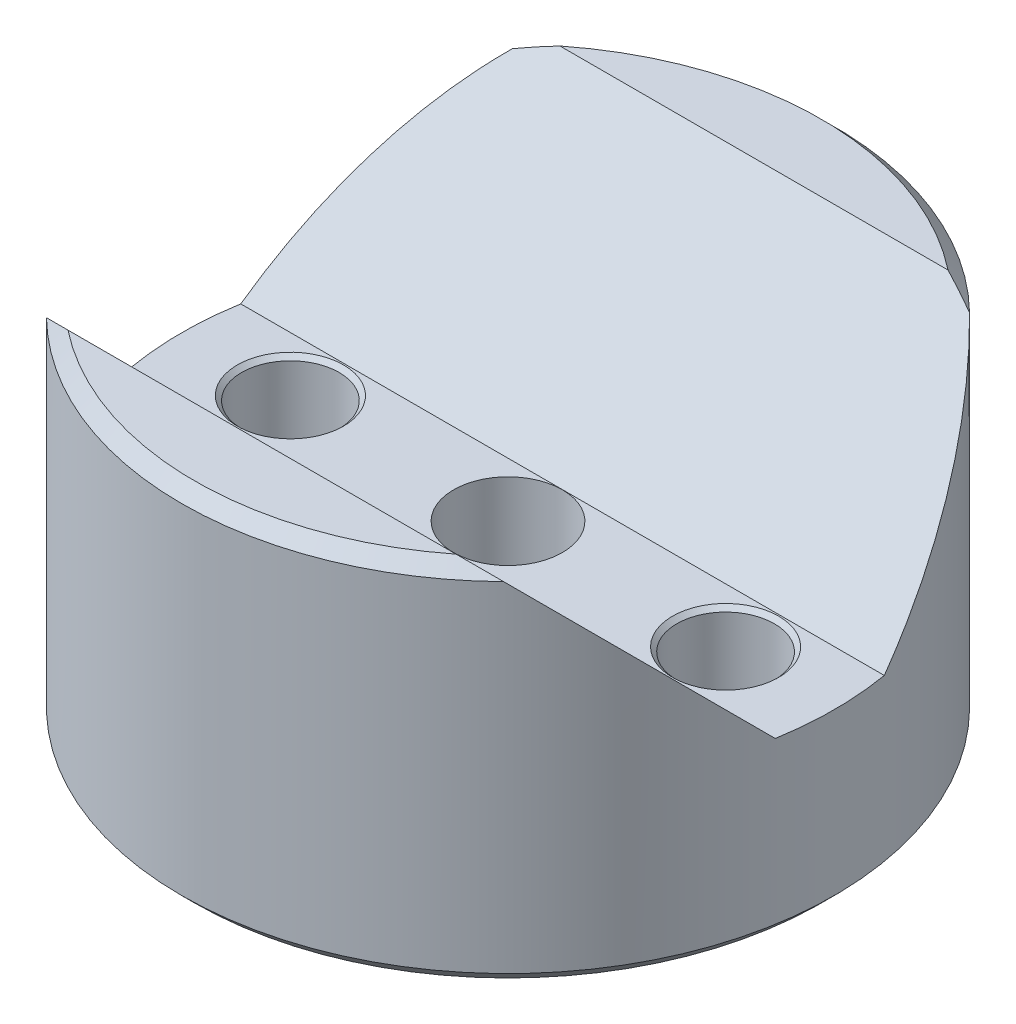
ISO-10303-21;
HEADER;
FILE_DESCRIPTION(('STEP AP214'),'2;1');
FILE_NAME('part.step','',(''),(''),'','','');
FILE_SCHEMA(('AUTOMOTIVE_DESIGN { 1 0 10303 214 1 1 1 1 }'));
ENDSEC;
DATA;
#1=APPLICATION_CONTEXT('core data for automotive mechanical design processes');
#2=APPLICATION_PROTOCOL_DEFINITION('international standard','automotive_design',2000,#1);
#3=PRODUCT_CONTEXT('',#1,'mechanical');
#4=PRODUCT('Part','Part','',(#3));
#5=PRODUCT_RELATED_PRODUCT_CATEGORY('part','',(#4));
#6=PRODUCT_DEFINITION_FORMATION('','',#4);
#7=PRODUCT_DEFINITION_CONTEXT('part definition',#1,'design');
#8=PRODUCT_DEFINITION('design','',#6,#7);
#9=PRODUCT_DEFINITION_SHAPE('','',#8);
#10=(LENGTH_UNIT() NAMED_UNIT(*) SI_UNIT(.MILLI.,.METRE.));
#11=(NAMED_UNIT(*) PLANE_ANGLE_UNIT() SI_UNIT($,.RADIAN.));
#12=(NAMED_UNIT(*) SI_UNIT($,.STERADIAN.) SOLID_ANGLE_UNIT());
#13=UNCERTAINTY_MEASURE_WITH_UNIT(LENGTH_MEASURE(1.E-05),#10,'distance_accuracy_value','');
#14=(GEOMETRIC_REPRESENTATION_CONTEXT(3) GLOBAL_UNCERTAINTY_ASSIGNED_CONTEXT((#13)) GLOBAL_UNIT_ASSIGNED_CONTEXT((#10,
#11,#12)) REPRESENTATION_CONTEXT('',''));
#15=CARTESIAN_POINT('',(0.,0.,0.));
#16=DIRECTION('',(0.,0.,1.));
#17=DIRECTION('',(1.,0.,0.));
#18=AXIS2_PLACEMENT_3D('',#15,#16,#17);
#19=CARTESIAN_POINT('',(0.,10.668,0.));
#20=DIRECTION('',(0.,-1.,0.));
#21=DIRECTION('',(0.,0.,-1.));
#22=AXIS2_PLACEMENT_3D('',#19,#20,#21);
#23=PLANE('',#22);
#24=DIRECTION('',(1.,0.,0.));
#25=VECTOR('',#24,1.);
#26=CARTESIAN_POINT('',(-9.525,10.668,7.17969209080187));
#27=LINE('',#26,#25);
#28=CARTESIAN_POINT('',(-5.66257516341084,10.668,7.17969209080187));
#29=VERTEX_POINT('',#28);
#30=CARTESIAN_POINT('',(5.66257516341084,10.668,7.17969209080187));
#31=VERTEX_POINT('',#30);
#32=EDGE_CURVE('E126',#29,#31,#27,.T.);
#33=ORIENTED_EDGE('',*,*,#32,.F.);
#34=CARTESIAN_POINT('',(0.,10.668,0.));
#35=DIRECTION('',(0.,-1.,0.));
#36=DIRECTION('',(0.,0.,-1.));
#37=AXIS2_PLACEMENT_3D('',#34,#35,#36);
#38=CIRCLE('',#37,9.14400000000001);
#39=EDGE_CURVE('E193',#29,#31,#38,.F.);
#40=ORIENTED_EDGE('',*,*,#39,.T.);
#41=EDGE_LOOP('',(#33,#40));
#42=FACE_BOUND('',#41,.T.);
#43=ADVANCED_FACE('F31',(#42),#23,.F.);
#44=DIRECTION('',(1.,0.,0.));
#45=VECTOR('',#44,1.);
#46=CARTESIAN_POINT('',(-9.525,10.668,-7.17969209080187));
#47=LINE('',#46,#45);
#48=CARTESIAN_POINT('',(-5.66257516341084,10.668,-7.17969209080187));
#49=VERTEX_POINT('',#48);
#50=CARTESIAN_POINT('',(5.66257516341084,10.668,-7.17969209080187));
#51=VERTEX_POINT('',#50);
#52=EDGE_CURVE('E124',#49,#51,#47,.T.);
#53=ORIENTED_EDGE('',*,*,#52,.T.);
#54=CARTESIAN_POINT('',(0.,10.668,0.));
#55=DIRECTION('',(0.,-1.,0.));
#56=DIRECTION('',(0.,0.,-1.));
#57=AXIS2_PLACEMENT_3D('',#54,#55,#56);
#58=CIRCLE('',#57,9.14400000000001);
#59=EDGE_CURVE('E427',#51,#49,#58,.F.);
#60=ORIENTED_EDGE('',*,*,#59,.T.);
#61=EDGE_LOOP('',(#53,#60));
#62=FACE_BOUND('',#61,.T.);
#63=ADVANCED_FACE('F33',(#62),#23,.F.);
#64=CARTESIAN_POINT('',(0.,38.791315640334,0.));
#65=DIRECTION('',(0.,1.,0.));
#66=DIRECTION('',(0.,0.,1.));
#67=AXIS2_PLACEMENT_3D('',#64,#65,#66);
#68=CYLINDRICAL_SURFACE('',#67,9.525);
#69=CARTESIAN_POINT('',(0.,0.381000000000006,0.));
#70=DIRECTION('',(0.,1.,0.));
#71=DIRECTION('',(0.,0.,1.));
#72=AXIS2_PLACEMENT_3D('',#69,#70,#71);
#73=CIRCLE('',#72,9.525);
#74=CARTESIAN_POINT('',(0.,0.381000000000006,9.525));
#75=VERTEX_POINT('',#74);
#76=EDGE_CURVE('E423',#75,#75,#73,.T.);
#77=ORIENTED_EDGE('',*,*,#76,.T.);
#78=EDGE_LOOP('',(#77));
#79=FACE_BOUND('',#78,.T.);
#80=CARTESIAN_POINT('',(0.,3.48830790919814,0.));
#81=DIRECTION('',(0.,-0.707106781186548,0.707106781186547));
#82=DIRECTION('',(0.,0.707106781186547,0.707106781186548));
#83=AXIS2_PLACEMENT_3D('',#80,#81,#82);
#84=ELLIPSE('',#83,13.4703841816037,9.525);
#85=CARTESIAN_POINT('',(9.3910671006057,5.08,1.59169209080187));
#86=VERTEX_POINT('',#85);
#87=CARTESIAN_POINT('',(6.67108768151553,10.287,6.79869209080186));
#88=VERTEX_POINT('',#87);
#89=EDGE_CURVE('E118',#86,#88,#84,.T.);
#90=ORIENTED_EDGE('',*,*,#89,.T.);
#91=CARTESIAN_POINT('',(0.,10.287,0.));
#92=DIRECTION('',(0.,-1.,0.));
#93=DIRECTION('',(0.,0.,-1.));
#94=AXIS2_PLACEMENT_3D('',#91,#92,#93);
#95=CIRCLE('',#94,9.525);
#96=CARTESIAN_POINT('',(-6.67108768151552,10.287,6.79869209080187));
#97=VERTEX_POINT('',#96);
#98=EDGE_CURVE('E424',#88,#97,#95,.T.);
#99=ORIENTED_EDGE('',*,*,#98,.T.);
#100=CARTESIAN_POINT('',(-9.3910671006057,5.08,1.59169209080187));
#101=VERTEX_POINT('',#100);
#102=EDGE_CURVE('E107',#97,#101,#84,.T.);
#103=ORIENTED_EDGE('',*,*,#102,.T.);
#104=CARTESIAN_POINT('',(0.,5.08,0.));
#105=DIRECTION('',(0.,-1.,0.));
#106=DIRECTION('',(0.,0.,-1.));
#107=AXIS2_PLACEMENT_3D('',#104,#105,#106);
#108=CIRCLE('',#107,9.525);
#109=CARTESIAN_POINT('',(-9.3910671006057,5.08,-1.59169209080187));
#110=VERTEX_POINT('',#109);
#111=EDGE_CURVE('E121',#101,#110,#108,.T.);
#112=ORIENTED_EDGE('',*,*,#111,.T.);
#113=CARTESIAN_POINT('',(0.,3.48830790919814,0.));
#114=DIRECTION('',(0.,-0.707106781186548,-0.707106781186547));
#115=DIRECTION('',(0.,0.707106781186547,-0.707106781186548));
#116=AXIS2_PLACEMENT_3D('',#113,#114,#115);
#117=ELLIPSE('',#116,13.4703841816037,9.525);
#118=CARTESIAN_POINT('',(-6.67108768151553,10.287,-6.79869209080186));
#119=VERTEX_POINT('',#118);
#120=EDGE_CURVE('E109',#110,#119,#117,.T.);
#121=ORIENTED_EDGE('',*,*,#120,.T.);
#122=CARTESIAN_POINT('',(0.,10.287,0.));
#123=DIRECTION('',(0.,-1.,0.));
#124=DIRECTION('',(0.,0.,-1.));
#125=AXIS2_PLACEMENT_3D('',#122,#123,#124);
#126=CIRCLE('',#125,9.525);
#127=CARTESIAN_POINT('',(6.67108768151552,10.287,-6.79869209080187));
#128=VERTEX_POINT('',#127);
#129=EDGE_CURVE('E104',#119,#128,#126,.T.);
#130=ORIENTED_EDGE('',*,*,#129,.T.);
#131=CARTESIAN_POINT('',(9.3910671006057,5.08,-1.59169209080187));
#132=VERTEX_POINT('',#131);
#133=EDGE_CURVE('E98',#128,#132,#117,.T.);
#134=ORIENTED_EDGE('',*,*,#133,.T.);
#135=EDGE_CURVE('E102',#132,#86,#108,.T.);
#136=ORIENTED_EDGE('',*,*,#135,.T.);
#137=EDGE_LOOP('',(#90,#99,#103,#112,#121,#130,#134,#136));
#138=FACE_BOUND('',#137,.T.);
#139=ADVANCED_FACE('F101',(#79,#138),#68,.T.);
#140=CARTESIAN_POINT('',(9.525,0.,0.));
#141=DIRECTION('',(0.,1.,0.));
#142=DIRECTION('',(0.,0.,1.));
#143=AXIS2_PLACEMENT_3D('',#140,#141,#142);
#144=PLANE('',#143);
#145=CARTESIAN_POINT('',(0.,0.,0.));
#146=DIRECTION('',(0.,1.,0.));
#147=DIRECTION('',(0.,0.,1.));
#148=AXIS2_PLACEMENT_3D('',#145,#146,#147);
#149=CIRCLE('',#148,9.144);
#150=CARTESIAN_POINT('',(0.,0.,9.144));
#151=VERTEX_POINT('',#150);
#152=EDGE_CURVE('E239',#151,#151,#149,.F.);
#153=ORIENTED_EDGE('',*,*,#152,.T.);
#154=EDGE_LOOP('',(#153));
#155=FACE_BOUND('',#154,.T.);
#156=CARTESIAN_POINT('',(0.,0.,0.));
#157=DIRECTION('',(0.,1.,0.));
#158=DIRECTION('',(0.,0.,1.));
#159=AXIS2_PLACEMENT_3D('',#156,#157,#158);
#160=CIRCLE('',#159,4.73075);
#161=CARTESIAN_POINT('',(4.695345575,0.,-0.577689790309559));
#162=VERTEX_POINT('',#161);
#163=CARTESIAN_POINT('',(-4.695345575,0.,-0.577689790309559));
#164=VERTEX_POINT('',#163);
#165=EDGE_CURVE('E119',#162,#164,#160,.T.);
#166=ORIENTED_EDGE('',*,*,#165,.T.);
#167=CARTESIAN_POINT('',(-6.35,0.,0.));
#168=DIRECTION('',(0.,1.,0.));
#169=DIRECTION('',(0.,0.,1.));
#170=AXIS2_PLACEMENT_3D('',#167,#168,#169);
#171=CIRCLE('',#170,1.75259999999999);
#172=CARTESIAN_POINT('',(-4.695345575,0.,0.577689790309557));
#173=VERTEX_POINT('',#172);
#174=EDGE_CURVE('E147',#164,#173,#171,.T.);
#175=ORIENTED_EDGE('',*,*,#174,.T.);
#176=CARTESIAN_POINT('',(4.695345575,0.,0.577689790309557));
#177=VERTEX_POINT('',#176);
#178=EDGE_CURVE('E135',#173,#177,#160,.T.);
#179=ORIENTED_EDGE('',*,*,#178,.T.);
#180=CARTESIAN_POINT('',(6.35,0.,0.));
#181=DIRECTION('',(0.,1.,0.));
#182=DIRECTION('',(0.,0.,1.));
#183=AXIS2_PLACEMENT_3D('',#180,#181,#182);
#184=CIRCLE('',#183,1.75259999999999);
#185=EDGE_CURVE('E144',#177,#162,#184,.T.);
#186=ORIENTED_EDGE('',*,*,#185,.T.);
#187=EDGE_LOOP('',(#166,#175,#179,#186));
#188=FACE_BOUND('',#187,.T.);
#189=ADVANCED_FACE('F172',(#155,#188),#144,.F.);
#190=CARTESIAN_POINT('',(0.,0.761999999999999,0.));
#191=DIRECTION('',(0.,-1.,0.));
#192=DIRECTION('',(0.,0.,-1.));
#193=AXIS2_PLACEMENT_3D('',#190,#191,#192);
#194=CONICAL_SURFACE('',#193,3.96875,0.785398163397447);
#195=ORIENTED_EDGE('',*,*,#178,.F.);
#196=CARTESIAN_POINT('',(-4.695345575,0.,0.577689790309557));
#197=CARTESIAN_POINT('',(-4.68831018009092,0.0150008425231445,0.512180586381788));
#198=CARTESIAN_POINT('',(-4.68237749437721,0.0276504924238668,0.44598005694582));
#199=CARTESIAN_POINT('',(-4.67289186946982,0.0478757054982618,0.31259709691346));
#200=CARTESIAN_POINT('',(-4.66934060184203,0.055447704565312,0.245414010368473));
#201=CARTESIAN_POINT('',(-4.66485091458584,0.0650205981822238,0.111998285424464));
#202=CARTESIAN_POINT('',(-4.66385836929607,0.0671368992604502,0.0457759474435807));
#203=CARTESIAN_POINT('',(-4.66437042204158,0.0660451021525831,-0.0865718193695664));
#204=CARTESIAN_POINT('',(-4.66587336732389,0.0628405279599467,-0.152697283334436));
#205=CARTESIAN_POINT('',(-4.67107618149544,0.0517471078083403,-0.278783318440494));
#206=CARTESIAN_POINT('',(-4.67457855277451,0.0442793654691221,-0.338790355216577));
#207=CARTESIAN_POINT('',(-4.68352412545564,0.025205649934684,-0.458618348568281));
#208=CARTESIAN_POINT('',(-4.6889863608596,0.013559092510495,-0.518431461457589));
#209=CARTESIAN_POINT('',(-4.69534557499999,0.,-0.577689790309561));
#210=B_SPLINE_CURVE_WITH_KNOTS('',3,(#196,#197,#198,#199,#200,#201,#202,#203,#204,#205,#206,
#207,#208,#209),.UNSPECIFIED.,.F.,.F.,(4,2,2,2,2,2,4),(0.,0.202714499281736,0.405571139478602,
0.60410007859846,0.802497585270774,0.984039367724023,1.16739423304788),.UNSPECIFIED.);
#211=EDGE_CURVE('E157',#173,#164,#210,.T.);
#212=ORIENTED_EDGE('',*,*,#211,.T.);
#213=ORIENTED_EDGE('',*,*,#165,.F.);
#214=CARTESIAN_POINT('',(4.695345575,0.,-0.577689790309559));
#215=CARTESIAN_POINT('',(4.68831018009092,0.0150008425231437,-0.51218058638179));
#216=CARTESIAN_POINT('',(4.68237749437721,0.0276504924238661,-0.445980056945822));
#217=CARTESIAN_POINT('',(4.67289186946982,0.0478757054982614,-0.312597096913462));
#218=CARTESIAN_POINT('',(4.66934060184203,0.0554477045653121,-0.245414010368475));
#219=CARTESIAN_POINT('',(4.66485091458584,0.065020598182224,-0.111998285424467));
#220=CARTESIAN_POINT('',(4.66385836929607,0.0671368992604502,-0.0457759474435831));
#221=CARTESIAN_POINT('',(4.66437042204158,0.066045102152583,0.0865718193695641));
#222=CARTESIAN_POINT('',(4.66587336732389,0.0628405279599466,0.152697283334434));
#223=CARTESIAN_POINT('',(4.67107618149544,0.0517471078083402,0.278783318440492));
#224=CARTESIAN_POINT('',(4.67457855277451,0.0442793654691219,0.338790355216575));
#225=CARTESIAN_POINT('',(4.68352412545564,0.0252056499346839,0.458618348568279));
#226=CARTESIAN_POINT('',(4.6889863608596,0.013559092510495,0.518431461457586));
#227=CARTESIAN_POINT('',(4.69534557499999,0.,0.577689790309558));
#228=B_SPLINE_CURVE_WITH_KNOTS('',3,(#214,#215,#216,#217,#218,#219,#220,#221,#222,#223,#224,
#225,#226,#227),.UNSPECIFIED.,.F.,.F.,(4,2,2,2,2,2,4),(0.,0.202714499281736,0.405571139478602,
0.60410007859846,0.802497585270774,0.984039367724023,1.16739423304788),.UNSPECIFIED.);
#229=EDGE_CURVE('E150',#162,#177,#228,.T.);
#230=ORIENTED_EDGE('',*,*,#229,.T.);
#231=EDGE_LOOP('',(#195,#212,#213,#230));
#232=FACE_BOUND('',#231,.T.);
#233=CARTESIAN_POINT('',(0.,0.761999999999999,0.));
#234=DIRECTION('',(0.,1.,0.));
#235=DIRECTION('',(0.,0.,1.));
#236=AXIS2_PLACEMENT_3D('',#233,#234,#235);
#237=CIRCLE('',#236,3.96875);
#238=CARTESIAN_POINT('',(0.,0.761999999999999,3.96875));
#239=VERTEX_POINT('',#238);
#240=EDGE_CURVE('E132',#239,#239,#237,.T.);
#241=ORIENTED_EDGE('',*,*,#240,.T.);
#242=EDGE_LOOP('',(#241));
#243=FACE_BOUND('',#242,.T.);
#244=ADVANCED_FACE('F166',(#232,#243),#194,.F.);
#245=CARTESIAN_POINT('',(3.96875,0.761999999999999,0.));
#246=DIRECTION('',(0.,1.,0.));
#247=DIRECTION('',(0.,0.,1.));
#248=AXIS2_PLACEMENT_3D('',#245,#246,#247);
#249=PLANE('',#248);
#250=CARTESIAN_POINT('',(0.,0.761999999999999,0.));
#251=DIRECTION('',(0.,1.,0.));
#252=DIRECTION('',(0.,0.,1.));
#253=AXIS2_PLACEMENT_3D('',#250,#251,#252);
#254=CIRCLE('',#253,1.5875);
#255=CARTESIAN_POINT('',(0.,0.761999999999999,1.5875));
#256=VERTEX_POINT('',#255);
#257=EDGE_CURVE('E128',#256,#256,#254,.T.);
#258=ORIENTED_EDGE('',*,*,#257,.T.);
#259=EDGE_LOOP('',(#258));
#260=FACE_BOUND('',#259,.T.);
#261=ORIENTED_EDGE('',*,*,#240,.F.);
#262=EDGE_LOOP('',(#261));
#263=FACE_BOUND('',#262,.T.);
#264=ADVANCED_FACE('F171',(#260,#263),#249,.F.);
#265=CARTESIAN_POINT('',(-9.525,5.08,1.59169209080187));
#266=DIRECTION('',(0.,-0.707106781186548,0.707106781186547));
#267=DIRECTION('',(0.,-0.707106781186547,-0.707106781186548));
#268=AXIS2_PLACEMENT_3D('',#265,#266,#267);
#269=PLANE('',#268);
#270=ORIENTED_EDGE('',*,*,#32,.T.);
#271=CARTESIAN_POINT('',(5.66257516341084,10.668,7.17969209080187));
#272=CARTESIAN_POINT('',(5.74815082095331,10.6383144035053,7.1500064943072));
#273=CARTESIAN_POINT('',(5.83334943056012,10.6080866623755,7.11977875317735));
#274=CARTESIAN_POINT('',(6.00296314032752,10.5465930627122,7.05828515351404));
#275=CARTESIAN_POINT('',(6.08737845951343,10.5153275062981,7.02701959709993));
#276=CARTESIAN_POINT('',(6.25544425340752,10.4517877698369,6.96347986063879));
#277=CARTESIAN_POINT('',(6.33909474012284,10.4195136056593,6.93120569646121));
#278=CARTESIAN_POINT('',(6.50565420021985,10.353982746107,6.86567483690883));
#279=CARTESIAN_POINT('',(6.5885629525713,10.3207257697858,6.83241786058766));
#280=CARTESIAN_POINT('',(6.67108768151552,10.287,6.79869209080187));
#281=B_SPLINE_CURVE_WITH_KNOTS('',3,(#271,#272,#273,#274,#275,#276,#277,#278,#279,#280),
.UNSPECIFIED.,.F.,.F.,(4,2,2,2,4),(0.,0.285951213847819,0.571819901904155,0.857684094359229,
1.14363080975657),.UNSPECIFIED.);
#282=EDGE_CURVE('E200',#31,#88,#281,.T.);
#283=ORIENTED_EDGE('',*,*,#282,.T.);
#284=ORIENTED_EDGE('',*,*,#89,.F.);
#285=DIRECTION('',(1.,0.,0.));
#286=VECTOR('',#285,1.);
#287=CARTESIAN_POINT('',(-9.525,5.08,1.59169209080187));
#288=LINE('',#287,#286);
#289=EDGE_CURVE('E117',#101,#86,#288,.T.);
#290=ORIENTED_EDGE('',*,*,#289,.F.);
#291=ORIENTED_EDGE('',*,*,#102,.F.);
#292=CARTESIAN_POINT('',(-6.67108768151552,10.287,6.79869209080187));
#293=CARTESIAN_POINT('',(-6.5885629525713,10.3207257697858,6.83241786058766));
#294=CARTESIAN_POINT('',(-6.50565420021985,10.353982746107,6.86567483690883));
#295=CARTESIAN_POINT('',(-6.33909474012284,10.4195136056593,6.93120569646121));
#296=CARTESIAN_POINT('',(-6.25544425340752,10.4517877698369,6.96347986063879));
#297=CARTESIAN_POINT('',(-6.08737845951343,10.5153275062981,7.02701959709993));
#298=CARTESIAN_POINT('',(-6.00296314032752,10.5465930627122,7.05828515351404));
#299=CARTESIAN_POINT('',(-5.83334943056012,10.6080866623755,7.11977875317735));
#300=CARTESIAN_POINT('',(-5.74815082095331,10.6383144035053,7.1500064943072));
#301=CARTESIAN_POINT('',(-5.66257516341084,10.668,7.17969209080187));
#302=B_SPLINE_CURVE_WITH_KNOTS('',3,(#292,#293,#294,#295,#296,#297,#298,#299,#300,#301),
.UNSPECIFIED.,.F.,.F.,(4,2,2,2,4),(0.,0.285946715397338,0.571810907852412,0.857679595908749,
1.14363080975657),.UNSPECIFIED.);
#303=EDGE_CURVE('E199',#97,#29,#302,.T.);
#304=ORIENTED_EDGE('',*,*,#303,.T.);
#305=EDGE_LOOP('',(#270,#283,#284,#290,#291,#304));
#306=FACE_BOUND('',#305,.T.);
#307=ADVANCED_FACE('F215',(#306),#269,.F.);
#308=CARTESIAN_POINT('',(-9.525,10.668,-7.17969209080187));
#309=DIRECTION('',(0.,-0.707106781186548,-0.707106781186547));
#310=DIRECTION('',(0.,0.707106781186547,-0.707106781186548));
#311=AXIS2_PLACEMENT_3D('',#308,#309,#310);
#312=PLANE('',#311);
#313=ORIENTED_EDGE('',*,*,#52,.F.);
#314=CARTESIAN_POINT('',(-5.66257516341084,10.668,-7.17969209080187));
#315=CARTESIAN_POINT('',(-5.74815082095331,10.6383144035053,-7.1500064943072));
#316=CARTESIAN_POINT('',(-5.83334943056012,10.6080866623755,-7.11977875317735));
#317=CARTESIAN_POINT('',(-6.00296314032752,10.5465930627122,-7.05828515351404));
#318=CARTESIAN_POINT('',(-6.08737845951343,10.5153275062981,-7.02701959709993));
#319=CARTESIAN_POINT('',(-6.25544425340752,10.4517877698369,-6.96347986063879));
#320=CARTESIAN_POINT('',(-6.33909474012284,10.4195136056593,-6.93120569646121));
#321=CARTESIAN_POINT('',(-6.50565420021985,10.353982746107,-6.86567483690883));
#322=CARTESIAN_POINT('',(-6.5885629525713,10.3207257697858,-6.83241786058766));
#323=CARTESIAN_POINT('',(-6.67108768151552,10.287,-6.79869209080187));
#324=B_SPLINE_CURVE_WITH_KNOTS('',3,(#314,#315,#316,#317,#318,#319,#320,#321,#322,#323),
.UNSPECIFIED.,.F.,.F.,(4,2,2,2,4),(0.,0.285951213847819,0.571819901904155,0.857684094359229,
1.14363080975657),.UNSPECIFIED.);
#325=EDGE_CURVE('E54',#49,#119,#324,.T.);
#326=ORIENTED_EDGE('',*,*,#325,.T.);
#327=ORIENTED_EDGE('',*,*,#120,.F.);
#328=DIRECTION('',(1.,0.,0.));
#329=VECTOR('',#328,1.);
#330=CARTESIAN_POINT('',(-9.525,5.08,-1.59169209080187));
#331=LINE('',#330,#329);
#332=EDGE_CURVE('E114',#110,#132,#331,.T.);
#333=ORIENTED_EDGE('',*,*,#332,.T.);
#334=ORIENTED_EDGE('',*,*,#133,.F.);
#335=CARTESIAN_POINT('',(6.67108768151552,10.287,-6.79869209080187));
#336=CARTESIAN_POINT('',(6.5885629525713,10.3207257697858,-6.83241786058766));
#337=CARTESIAN_POINT('',(6.50565420021985,10.353982746107,-6.86567483690883));
#338=CARTESIAN_POINT('',(6.33909474012284,10.4195136056593,-6.93120569646121));
#339=CARTESIAN_POINT('',(6.25544425340752,10.4517877698369,-6.96347986063879));
#340=CARTESIAN_POINT('',(6.08737845951343,10.5153275062981,-7.02701959709993));
#341=CARTESIAN_POINT('',(6.00296314032752,10.5465930627122,-7.05828515351404));
#342=CARTESIAN_POINT('',(5.83334943056012,10.6080866623755,-7.11977875317735));
#343=CARTESIAN_POINT('',(5.74815082095331,10.6383144035053,-7.1500064943072));
#344=CARTESIAN_POINT('',(5.66257516341084,10.668,-7.17969209080187));
#345=B_SPLINE_CURVE_WITH_KNOTS('',3,(#335,#336,#337,#338,#339,#340,#341,#342,#343,#344),
.UNSPECIFIED.,.F.,.F.,(4,2,2,2,4),(0.,0.285946715397338,0.571810907852412,0.857679595908749,
1.14363080975657),.UNSPECIFIED.);
#346=EDGE_CURVE('E46',#128,#51,#345,.T.);
#347=ORIENTED_EDGE('',*,*,#346,.T.);
#348=EDGE_LOOP('',(#313,#326,#327,#333,#334,#347));
#349=FACE_BOUND('',#348,.T.);
#350=ADVANCED_FACE('F122',(#349),#312,.F.);
#351=CARTESIAN_POINT('',(-9.525,5.08,1.59169209080187));
#352=DIRECTION('',(0.,-1.,0.));
#353=DIRECTION('',(0.,0.,-1.));
#354=AXIS2_PLACEMENT_3D('',#351,#352,#353);
#355=PLANE('',#354);
#356=CARTESIAN_POINT('',(6.35,5.08,0.));
#357=DIRECTION('',(0.,-1.,0.));
#358=DIRECTION('',(0.,0.,-1.));
#359=AXIS2_PLACEMENT_3D('',#356,#357,#358);
#360=CIRCLE('',#359,1.5494);
#361=CARTESIAN_POINT('',(6.35,5.08,-1.5494));
#362=VERTEX_POINT('',#361);
#363=EDGE_CURVE('E265',#362,#362,#360,.T.);
#364=ORIENTED_EDGE('',*,*,#363,.T.);
#365=EDGE_LOOP('',(#364));
#366=FACE_BOUND('',#365,.T.);
#367=CARTESIAN_POINT('',(-6.35,5.08,0.));
#368=DIRECTION('',(0.,-1.,0.));
#369=DIRECTION('',(0.,0.,-1.));
#370=AXIS2_PLACEMENT_3D('',#367,#368,#369);
#371=CIRCLE('',#370,1.54939999999999);
#372=CARTESIAN_POINT('',(-6.35,5.08,-1.54939999999999));
#373=VERTEX_POINT('',#372);
#374=EDGE_CURVE('E263',#373,#373,#371,.T.);
#375=ORIENTED_EDGE('',*,*,#374,.T.);
#376=EDGE_LOOP('',(#375));
#377=FACE_BOUND('',#376,.T.);
#378=CARTESIAN_POINT('',(0.,5.08,0.));
#379=DIRECTION('',(0.,-1.,0.));
#380=DIRECTION('',(0.,0.,-1.));
#381=AXIS2_PLACEMENT_3D('',#378,#379,#380);
#382=CIRCLE('',#381,1.5875);
#383=CARTESIAN_POINT('',(0.,5.08,-1.5875));
#384=VERTEX_POINT('',#383);
#385=EDGE_CURVE('E139',#384,#384,#382,.T.);
#386=ORIENTED_EDGE('',*,*,#385,.T.);
#387=EDGE_LOOP('',(#386));
#388=FACE_BOUND('',#387,.T.);
#389=ORIENTED_EDGE('',*,*,#332,.F.);
#390=ORIENTED_EDGE('',*,*,#111,.F.);
#391=ORIENTED_EDGE('',*,*,#289,.T.);
#392=ORIENTED_EDGE('',*,*,#135,.F.);
#393=EDGE_LOOP('',(#389,#390,#391,#392));
#394=FACE_BOUND('',#393,.T.);
#395=ADVANCED_FACE('F112',(#366,#377,#388,#394),#355,.F.);
#396=CARTESIAN_POINT('',(0.,10.668,0.));
#397=DIRECTION('',(0.,-1.,0.));
#398=DIRECTION('',(0.,0.,-1.));
#399=AXIS2_PLACEMENT_3D('',#396,#397,#398);
#400=CYLINDRICAL_SURFACE('',#399,1.5875);
#401=ORIENTED_EDGE('',*,*,#385,.F.);
#402=EDGE_LOOP('',(#401));
#403=FACE_BOUND('',#402,.T.);
#404=ORIENTED_EDGE('',*,*,#257,.F.);
#405=EDGE_LOOP('',(#404));
#406=FACE_BOUND('',#405,.T.);
#407=ADVANCED_FACE('F222',(#403,#406),#400,.F.);
#408=CARTESIAN_POINT('',(6.35,10.668,0.));
#409=DIRECTION('',(0.,-1.,0.));
#410=DIRECTION('',(0.,0.,-1.));
#411=AXIS2_PLACEMENT_3D('',#408,#409,#410);
#412=CYLINDRICAL_SURFACE('',#411,1.4224);
#413=CARTESIAN_POINT('',(6.35,4.953,0.));
#414=DIRECTION('',(0.,-1.,0.));
#415=DIRECTION('',(0.,0.,-1.));
#416=AXIS2_PLACEMENT_3D('',#413,#414,#415);
#417=CIRCLE('',#416,1.4224);
#418=CARTESIAN_POINT('',(6.35,4.953,-1.4224));
#419=VERTEX_POINT('',#418);
#420=EDGE_CURVE('E39',#419,#419,#417,.F.);
#421=ORIENTED_EDGE('',*,*,#420,.T.);
#422=EDGE_LOOP('',(#421));
#423=FACE_BOUND('',#422,.T.);
#424=CARTESIAN_POINT('',(6.35,0.330199999999989,0.));
#425=DIRECTION('',(0.,1.,0.));
#426=DIRECTION('',(0.,0.,1.));
#427=AXIS2_PLACEMENT_3D('',#424,#425,#426);
#428=CIRCLE('',#427,1.4224);
#429=CARTESIAN_POINT('',(6.35,0.330199999999989,1.4224));
#430=VERTEX_POINT('',#429);
#431=EDGE_CURVE('E201',#430,#430,#428,.F.);
#432=ORIENTED_EDGE('',*,*,#431,.T.);
#433=EDGE_LOOP('',(#432));
#434=FACE_BOUND('',#433,.T.);
#435=ADVANCED_FACE('F272',(#423,#434),#412,.F.);
#436=CARTESIAN_POINT('',(-6.35,10.668,0.));
#437=DIRECTION('',(0.,-1.,0.));
#438=DIRECTION('',(0.,0.,-1.));
#439=AXIS2_PLACEMENT_3D('',#436,#437,#438);
#440=CYLINDRICAL_SURFACE('',#439,1.4224);
#441=CARTESIAN_POINT('',(-6.35,4.953,0.));
#442=DIRECTION('',(0.,-1.,0.));
#443=DIRECTION('',(0.,0.,-1.));
#444=AXIS2_PLACEMENT_3D('',#441,#442,#443);
#445=CIRCLE('',#444,1.4224);
#446=CARTESIAN_POINT('',(-6.35,4.953,-1.4224));
#447=VERTEX_POINT('',#446);
#448=EDGE_CURVE('E11',#447,#447,#445,.F.);
#449=ORIENTED_EDGE('',*,*,#448,.T.);
#450=EDGE_LOOP('',(#449));
#451=FACE_BOUND('',#450,.T.);
#452=CARTESIAN_POINT('',(-6.35,0.330199999999991,0.));
#453=DIRECTION('',(0.,1.,0.));
#454=DIRECTION('',(0.,0.,1.));
#455=AXIS2_PLACEMENT_3D('',#452,#453,#454);
#456=CIRCLE('',#455,1.4224);
#457=CARTESIAN_POINT('',(-6.35,0.330199999999991,1.4224));
#458=VERTEX_POINT('',#457);
#459=EDGE_CURVE('E106',#458,#458,#456,.F.);
#460=ORIENTED_EDGE('',*,*,#459,.T.);
#461=EDGE_LOOP('',(#460));
#462=FACE_BOUND('',#461,.T.);
#463=ADVANCED_FACE('F318',(#451,#462),#440,.F.);
#464=CARTESIAN_POINT('',(-6.35,0.330199999999991,0.));
#465=DIRECTION('',(0.,-1.,0.));
#466=DIRECTION('',(0.,0.,-1.));
#467=AXIS2_PLACEMENT_3D('',#464,#465,#466);
#468=CONICAL_SURFACE('',#467,1.4224,0.785398163397452);
#469=ORIENTED_EDGE('',*,*,#211,.F.);
#470=ORIENTED_EDGE('',*,*,#174,.F.);
#471=EDGE_LOOP('',(#469,#470));
#472=FACE_BOUND('',#471,.T.);
#473=ORIENTED_EDGE('',*,*,#459,.F.);
#474=EDGE_LOOP('',(#473));
#475=FACE_BOUND('',#474,.T.);
#476=ADVANCED_FACE('F324',(#472,#475),#468,.F.);
#477=CARTESIAN_POINT('',(6.35,0.330199999999989,0.));
#478=DIRECTION('',(0.,-1.,0.));
#479=DIRECTION('',(0.,0.,-1.));
#480=AXIS2_PLACEMENT_3D('',#477,#478,#479);
#481=CONICAL_SURFACE('',#480,1.4224,0.785398163397452);
#482=ORIENTED_EDGE('',*,*,#229,.F.);
#483=ORIENTED_EDGE('',*,*,#185,.F.);
#484=EDGE_LOOP('',(#482,#483));
#485=FACE_BOUND('',#484,.T.);
#486=ORIENTED_EDGE('',*,*,#431,.F.);
#487=EDGE_LOOP('',(#486));
#488=FACE_BOUND('',#487,.T.);
#489=ADVANCED_FACE('F163',(#485,#488),#481,.F.);
#490=CARTESIAN_POINT('',(0.,10.668,0.));
#491=DIRECTION('',(0.,-1.,0.));
#492=DIRECTION('',(0.,0.,-1.));
#493=AXIS2_PLACEMENT_3D('',#490,#491,#492);
#494=CONICAL_SURFACE('',#493,9.14400000000001,0.785398163397444);
#495=ORIENTED_EDGE('',*,*,#303,.F.);
#496=ORIENTED_EDGE('',*,*,#98,.F.);
#497=ORIENTED_EDGE('',*,*,#282,.F.);
#498=ORIENTED_EDGE('',*,*,#39,.F.);
#499=EDGE_LOOP('',(#495,#496,#497,#498));
#500=FACE_BOUND('',#499,.T.);
#501=ADVANCED_FACE('F197',(#500),#494,.T.);
#502=CARTESIAN_POINT('',(0.,10.668,0.));
#503=DIRECTION('',(0.,-1.,0.));
#504=DIRECTION('',(0.,0.,-1.));
#505=AXIS2_PLACEMENT_3D('',#502,#503,#504);
#506=CONICAL_SURFACE('',#505,9.14400000000001,0.785398163397444);
#507=ORIENTED_EDGE('',*,*,#346,.F.);
#508=ORIENTED_EDGE('',*,*,#129,.F.);
#509=ORIENTED_EDGE('',*,*,#325,.F.);
#510=ORIENTED_EDGE('',*,*,#59,.F.);
#511=EDGE_LOOP('',(#507,#508,#509,#510));
#512=FACE_BOUND('',#511,.T.);
#513=ADVANCED_FACE('F241',(#512),#506,.T.);
#514=CARTESIAN_POINT('',(0.,0.381000000000006,0.));
#515=DIRECTION('',(0.,1.,0.));
#516=DIRECTION('',(0.,0.,1.));
#517=AXIS2_PLACEMENT_3D('',#514,#515,#516);
#518=CONICAL_SURFACE('',#517,9.525,0.785398163397446);
#519=CARTESIAN_POINT('',(0.,0.,9.144));
#520=CARTESIAN_POINT('',(0.,0.00396874999999939,9.14796875));
#521=CARTESIAN_POINT('',(0.,0.00793749999999959,9.1519375));
#522=CARTESIAN_POINT('',(0.,0.015875,9.159875));
#523=CARTESIAN_POINT('',(0.,0.0198437500000002,9.16384375));
#524=CARTESIAN_POINT('',(0.,0.0277812500000004,9.17178125));
#525=CARTESIAN_POINT('',(0.,0.0317500000000003,9.17575));
#526=CARTESIAN_POINT('',(0.,0.0396875000000003,9.1836875));
#527=CARTESIAN_POINT('',(0.,0.0436562500000003,9.18765625));
#528=CARTESIAN_POINT('',(0.,0.0515937500000006,9.19559375));
#529=CARTESIAN_POINT('',(0.,0.0555625000000008,9.1995625));
#530=CARTESIAN_POINT('',(0.,0.063500000000001,9.2075));
#531=CARTESIAN_POINT('',(0.,0.067468750000001,9.21146875));
#532=CARTESIAN_POINT('',(0.,0.075406250000001,9.21940625));
#533=CARTESIAN_POINT('',(0.,0.0793750000000011,9.223375));
#534=CARTESIAN_POINT('',(0.,0.0873125000000012,9.2313125));
#535=CARTESIAN_POINT('',(0.,0.0912812500000012,9.23528125));
#536=CARTESIAN_POINT('',(0.,0.0992187500000014,9.24321875));
#537=CARTESIAN_POINT('',(0.,0.103187500000002,9.2471875));
#538=CARTESIAN_POINT('',(0.,0.111125000000002,9.255125));
#539=CARTESIAN_POINT('',(0.,0.115093750000002,9.25909375));
#540=CARTESIAN_POINT('',(0.,0.123031250000002,9.26703125));
#541=CARTESIAN_POINT('',(0.,0.127000000000002,9.271));
#542=CARTESIAN_POINT('',(0.,0.134937500000002,9.2789375));
#543=CARTESIAN_POINT('',(0.,0.138906250000002,9.28290625));
#544=CARTESIAN_POINT('',(0.,0.146843750000002,9.29084375));
#545=CARTESIAN_POINT('',(0.,0.150812500000002,9.2948125));
#546=CARTESIAN_POINT('',(0.,0.158750000000003,9.30275));
#547=CARTESIAN_POINT('',(0.,0.162718750000003,9.30671875));
#548=CARTESIAN_POINT('',(0.,0.170656250000003,9.31465625));
#549=CARTESIAN_POINT('',(0.,0.174625000000003,9.318625));
#550=CARTESIAN_POINT('',(0.,0.182562500000003,9.3265625));
#551=CARTESIAN_POINT('',(0.,0.186531250000003,9.33053125));
#552=CARTESIAN_POINT('',(0.,0.194468750000003,9.33846875));
#553=CARTESIAN_POINT('',(0.,0.198437500000003,9.3424375));
#554=CARTESIAN_POINT('',(0.,0.206375000000003,9.350375));
#555=CARTESIAN_POINT('',(0.,0.210343750000003,9.35434375));
#556=CARTESIAN_POINT('',(0.,0.218281250000003,9.36228125));
#557=CARTESIAN_POINT('',(0.,0.222250000000003,9.36625));
#558=CARTESIAN_POINT('',(0.,0.230187500000004,9.3741875));
#559=CARTESIAN_POINT('',(0.,0.234156250000004,9.37815625));
#560=CARTESIAN_POINT('',(0.,0.242093750000004,9.38609375));
#561=CARTESIAN_POINT('',(0.,0.246062500000004,9.3900625));
#562=CARTESIAN_POINT('',(0.,0.254000000000004,9.398));
#563=CARTESIAN_POINT('',(0.,0.257968750000004,9.40196875));
#564=CARTESIAN_POINT('',(0.,0.265906250000004,9.40990625));
#565=CARTESIAN_POINT('',(0.,0.269875000000004,9.413875));
#566=CARTESIAN_POINT('',(0.,0.277812500000005,9.4218125));
#567=CARTESIAN_POINT('',(0.,0.281781250000005,9.42578125));
#568=CARTESIAN_POINT('',(0.,0.289718750000005,9.43371875));
#569=CARTESIAN_POINT('',(0.,0.293687500000005,9.4376875));
#570=CARTESIAN_POINT('',(0.,0.301625000000005,9.445625));
#571=CARTESIAN_POINT('',(0.,0.305593750000005,9.44959375));
#572=CARTESIAN_POINT('',(0.,0.313531250000005,9.45753125));
#573=CARTESIAN_POINT('',(0.,0.317500000000005,9.4615));
#574=CARTESIAN_POINT('',(0.,0.325437500000006,9.4694375));
#575=CARTESIAN_POINT('',(0.,0.329406250000005,9.47340625));
#576=CARTESIAN_POINT('',(0.,0.337343750000005,9.48134375));
#577=CARTESIAN_POINT('',(0.,0.341312500000006,9.4853125));
#578=CARTESIAN_POINT('',(0.,0.349250000000006,9.49325));
#579=CARTESIAN_POINT('',(0.,0.353218750000006,9.49721875));
#580=CARTESIAN_POINT('',(0.,0.361156250000006,9.50515625));
#581=CARTESIAN_POINT('',(0.,0.365125000000006,9.509125));
#582=CARTESIAN_POINT('',(0.,0.373062500000006,9.5170625));
#583=CARTESIAN_POINT('',(0.,0.377031250000007,9.52103125));
#584=CARTESIAN_POINT('',(0.,0.381000000000006,9.525));
#585=B_SPLINE_CURVE_WITH_KNOTS('',3,(#519,#520,#521,#522,#523,#524,#525,#526,#527,#528,#529,
#530,#531,#532,#533,#534,#535,#536,#537,#538,#539,#540,#541,#542,#543,#544,#545,#546,#547,#548,
#549,#550,#551,#552,#553,#554,#555,#556,#557,#558,#559,#560,#561,#562,#563,#564,#565,#566,#567,
#568,#569,#570,#571,#572,#573,#574,#575,#576,#577,#578,#579,#580,#581,#582,#583,#584),
.UNSPECIFIED.,.F.,.F.,(4,2,2,2,2,2,2,2,2,2,2,2,2,2,2,2,2,2,2,2,2,2,2,2,2,2,2,2,2,2,2,2,4),(0.,
0.0168379802270053,0.0336759604540093,0.0505139406810145,0.0673519209080198,0.0841899011350238,
0.101027881362029,0.117865861589034,0.13470384181604,0.151541822043044,0.168379802270049,
0.185217782497054,0.202055762724059,0.218893742951063,0.235731723178069,0.252569703405074,
0.269407683632078,0.286245663859083,0.303083644086089,0.319921624313094,0.336759604540098,
0.353597584767103,0.370435564994108,0.387273545221112,0.404111525448118,0.420949505675123,
0.437787485902128,0.454625466129132,0.471463446356137,0.488301426583143,0.505139406810148,
0.521977387037152,0.538815367264157),.UNSPECIFIED.);
#586=EDGE_CURVE('BSEAM245',#151,#75,#585,.T.);
#587=ORIENTED_EDGE('',*,*,#152,.F.);
#588=ORIENTED_EDGE('',*,*,#76,.F.);
#589=ORIENTED_EDGE('',*,*,#586,.T.);
#590=ORIENTED_EDGE('',*,*,#586,.F.);
#591=EDGE_LOOP('',(#587,#589,#588,#590));
#592=FACE_BOUND('',#591,.T.);
#593=ADVANCED_FACE('F245',(#592),#518,.T.);
#594=CARTESIAN_POINT('',(6.35,5.08,0.));
#595=DIRECTION('',(0.,1.,0.));
#596=DIRECTION('',(0.,0.,1.));
#597=AXIS2_PLACEMENT_3D('',#594,#595,#596);
#598=CONICAL_SURFACE('',#597,1.5494,0.78539816339744);
#599=ORIENTED_EDGE('',*,*,#420,.F.);
#600=EDGE_LOOP('',(#599));
#601=FACE_BOUND('',#600,.T.);
#602=ORIENTED_EDGE('',*,*,#363,.F.);
#603=EDGE_LOOP('',(#602));
#604=FACE_BOUND('',#603,.T.);
#605=ADVANCED_FACE('F249',(#601,#604),#598,.F.);
#606=CARTESIAN_POINT('',(-6.35,5.08,0.));
#607=DIRECTION('',(0.,1.,0.));
#608=DIRECTION('',(0.,0.,1.));
#609=AXIS2_PLACEMENT_3D('',#606,#607,#608);
#610=CONICAL_SURFACE('',#609,1.54939999999999,0.785398163397438);
#611=ORIENTED_EDGE('',*,*,#448,.F.);
#612=EDGE_LOOP('',(#611));
#613=FACE_BOUND('',#612,.T.);
#614=ORIENTED_EDGE('',*,*,#374,.F.);
#615=EDGE_LOOP('',(#614));
#616=FACE_BOUND('',#615,.T.);
#617=ADVANCED_FACE('F253',(#613,#616),#610,.F.);
#618=CLOSED_SHELL('',(#43,#63,#139,#189,#244,#264,#307,#350,#395,#407,#435,#463,#476,#489,#501,
#513,#593,#605,#617));
#619=MANIFOLD_SOLID_BREP('B2',#618);
#620=ADVANCED_BREP_SHAPE_REPRESENTATION('',(#18,#619),#14);
#621=SHAPE_DEFINITION_REPRESENTATION(#9,#620);
ENDSEC;
END-ISO-10303-21;
